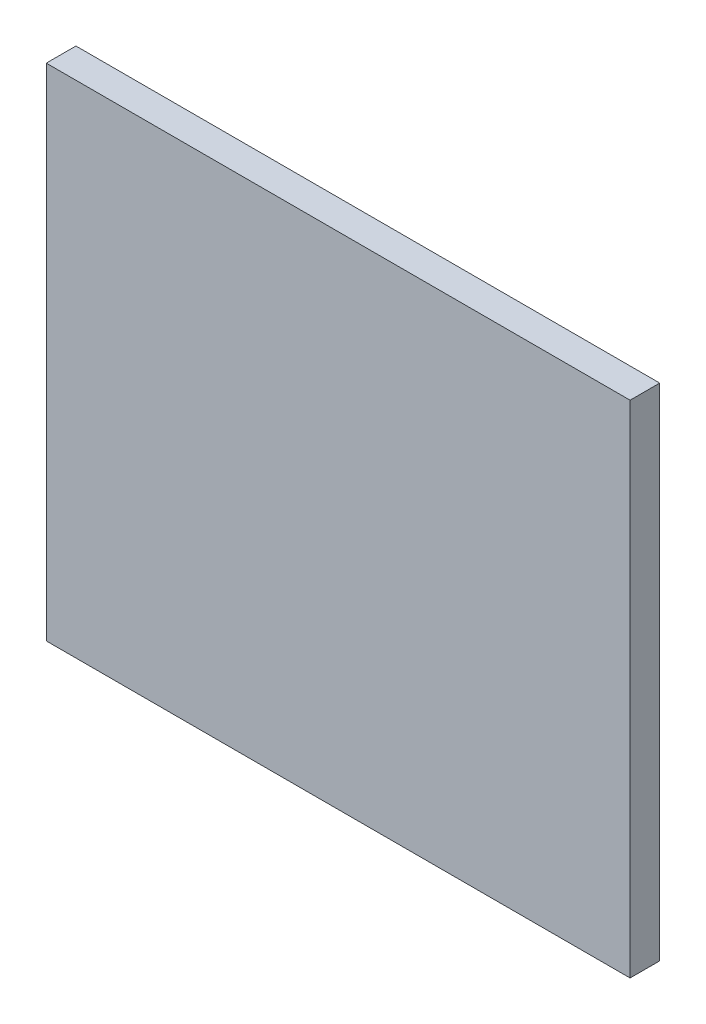
ISO-10303-21;
HEADER;
FILE_DESCRIPTION(('STEP AP214'),'2;1');
FILE_NAME('part.step','',(''),(''),'','','');
FILE_SCHEMA(('AUTOMOTIVE_DESIGN { 1 0 10303 214 1 1 1 1 }'));
ENDSEC;
DATA;
#1=APPLICATION_CONTEXT('core data for automotive mechanical design processes');
#2=APPLICATION_PROTOCOL_DEFINITION('international standard','automotive_design',2000,#1);
#3=PRODUCT_CONTEXT('',#1,'mechanical');
#4=PRODUCT('Part','Part','',(#3));
#5=PRODUCT_RELATED_PRODUCT_CATEGORY('part','',(#4));
#6=PRODUCT_DEFINITION_FORMATION('','',#4);
#7=PRODUCT_DEFINITION_CONTEXT('part definition',#1,'design');
#8=PRODUCT_DEFINITION('design','',#6,#7);
#9=PRODUCT_DEFINITION_SHAPE('','',#8);
#10=(LENGTH_UNIT() NAMED_UNIT(*) SI_UNIT(.MILLI.,.METRE.));
#11=(NAMED_UNIT(*) PLANE_ANGLE_UNIT() SI_UNIT($,.RADIAN.));
#12=(NAMED_UNIT(*) SI_UNIT($,.STERADIAN.) SOLID_ANGLE_UNIT());
#13=UNCERTAINTY_MEASURE_WITH_UNIT(LENGTH_MEASURE(1.E-05),#10,'distance_accuracy_value','');
#14=(GEOMETRIC_REPRESENTATION_CONTEXT(3) GLOBAL_UNCERTAINTY_ASSIGNED_CONTEXT((#13)) GLOBAL_UNIT_ASSIGNED_CONTEXT((#10,
#11,#12)) REPRESENTATION_CONTEXT('',''));
#15=CARTESIAN_POINT('',(0.,0.,0.));
#16=DIRECTION('',(0.,0.,1.));
#17=DIRECTION('',(1.,0.,0.));
#18=AXIS2_PLACEMENT_3D('',#15,#16,#17);
#19=CARTESIAN_POINT('',(98.6169967651367,84.4869995117188,0.));
#20=DIRECTION('',(0.,-1.,0.));
#21=DIRECTION('',(-1.,0.,0.));
#22=AXIS2_PLACEMENT_3D('',#19,#20,#21);
#23=PLANE('',#22);
#24=DIRECTION('',(-1.,0.,0.));
#25=VECTOR('',#24,1.);
#26=CARTESIAN_POINT('',(98.6169967651367,84.4869995117188,0.03556));
#27=LINE('',#26,#25);
#28=CARTESIAN_POINT('',(98.6169967651367,84.4869995117188,0.03556));
#29=VERTEX_POINT('',#28);
#30=CARTESIAN_POINT('',(97.9169998168945,84.4869995117188,0.03556));
#31=VERTEX_POINT('',#30);
#32=EDGE_CURVE('E11',#29,#31,#27,.T.);
#33=ORIENTED_EDGE('',*,*,#32,.F.);
#34=DIRECTION('',(0.,0.,1.));
#35=VECTOR('',#34,1.);
#36=CARTESIAN_POINT('',(98.6169967651367,84.4869995117188,0.));
#37=LINE('',#36,#35);
#38=CARTESIAN_POINT('',(98.6169967651367,84.4869995117188,0.));
#39=VERTEX_POINT('',#38);
#40=EDGE_CURVE('E24',#39,#29,#37,.T.);
#41=ORIENTED_EDGE('',*,*,#40,.F.);
#42=DIRECTION('',(-1.,0.,0.));
#43=VECTOR('',#42,1.);
#44=CARTESIAN_POINT('',(98.6169967651367,84.4869995117188,0.));
#45=LINE('',#44,#43);
#46=CARTESIAN_POINT('',(97.9169998168945,84.4869995117188,0.));
#47=VERTEX_POINT('',#46);
#48=EDGE_CURVE('E75',#39,#47,#45,.T.);
#49=ORIENTED_EDGE('',*,*,#48,.T.);
#50=DIRECTION('',(0.,0.,1.));
#51=VECTOR('',#50,1.);
#52=CARTESIAN_POINT('',(97.9169998168945,84.4869995117188,0.));
#53=LINE('',#52,#51);
#54=EDGE_CURVE('E37',#47,#31,#53,.T.);
#55=ORIENTED_EDGE('',*,*,#54,.T.);
#56=EDGE_LOOP('',(#33,#41,#49,#55));
#57=FACE_BOUND('',#56,.T.);
#58=ADVANCED_FACE('F17',(#57),#23,.F.);
#59=CARTESIAN_POINT('',(97.9169998168945,84.4869995117188,0.));
#60=DIRECTION('',(1.,0.,0.));
#61=DIRECTION('',(0.,-1.,0.));
#62=AXIS2_PLACEMENT_3D('',#59,#60,#61);
#63=PLANE('',#62);
#64=DIRECTION('',(0.,-1.,0.));
#65=VECTOR('',#64,1.);
#66=CARTESIAN_POINT('',(97.9169998168945,84.4869995117188,0.03556));
#67=LINE('',#66,#65);
#68=CARTESIAN_POINT('',(97.9169998168945,83.8870010375977,0.03556));
#69=VERTEX_POINT('',#68);
#70=EDGE_CURVE('E83',#31,#69,#67,.T.);
#71=ORIENTED_EDGE('',*,*,#70,.F.);
#72=ORIENTED_EDGE('',*,*,#54,.F.);
#73=DIRECTION('',(0.,-1.,0.));
#74=VECTOR('',#73,1.);
#75=CARTESIAN_POINT('',(97.9169998168945,84.4869995117188,0.));
#76=LINE('',#75,#74);
#77=CARTESIAN_POINT('',(97.9169998168945,83.8870010375977,0.));
#78=VERTEX_POINT('',#77);
#79=EDGE_CURVE('E81',#47,#78,#76,.T.);
#80=ORIENTED_EDGE('',*,*,#79,.T.);
#81=DIRECTION('',(0.,0.,1.));
#82=VECTOR('',#81,1.);
#83=CARTESIAN_POINT('',(97.9169998168945,83.8870010375977,0.));
#84=LINE('',#83,#82);
#85=EDGE_CURVE('E67',#78,#69,#84,.T.);
#86=ORIENTED_EDGE('',*,*,#85,.T.);
#87=EDGE_LOOP('',(#71,#72,#80,#86));
#88=FACE_BOUND('',#87,.T.);
#89=ADVANCED_FACE('F89',(#88),#63,.F.);
#90=CARTESIAN_POINT('',(97.9169998168945,83.8870010375977,0.));
#91=DIRECTION('',(0.,1.,0.));
#92=DIRECTION('',(1.,0.,0.));
#93=AXIS2_PLACEMENT_3D('',#90,#91,#92);
#94=PLANE('',#93);
#95=DIRECTION('',(1.,0.,0.));
#96=VECTOR('',#95,1.);
#97=CARTESIAN_POINT('',(97.9169998168945,83.8870010375977,0.03556));
#98=LINE('',#97,#96);
#99=CARTESIAN_POINT('',(98.6169967651367,83.8870010375977,0.03556));
#100=VERTEX_POINT('',#99);
#101=EDGE_CURVE('E71',#69,#100,#98,.T.);
#102=ORIENTED_EDGE('',*,*,#101,.F.);
#103=ORIENTED_EDGE('',*,*,#85,.F.);
#104=DIRECTION('',(1.,0.,0.));
#105=VECTOR('',#104,1.);
#106=CARTESIAN_POINT('',(97.9169998168945,83.8870010375977,0.));
#107=LINE('',#106,#105);
#108=CARTESIAN_POINT('',(98.6169967651367,83.8870010375977,0.));
#109=VERTEX_POINT('',#108);
#110=EDGE_CURVE('E63',#78,#109,#107,.T.);
#111=ORIENTED_EDGE('',*,*,#110,.T.);
#112=DIRECTION('',(0.,0.,1.));
#113=VECTOR('',#112,1.);
#114=CARTESIAN_POINT('',(98.6169967651367,83.8870010375977,0.));
#115=LINE('',#114,#113);
#116=EDGE_CURVE('E53',#109,#100,#115,.T.);
#117=ORIENTED_EDGE('',*,*,#116,.T.);
#118=EDGE_LOOP('',(#102,#103,#111,#117));
#119=FACE_BOUND('',#118,.T.);
#120=ADVANCED_FACE('F66',(#119),#94,.F.);
#121=CARTESIAN_POINT('',(98.6169967651367,83.8870010375977,0.));
#122=DIRECTION('',(-1.,0.,0.));
#123=DIRECTION('',(0.,1.,0.));
#124=AXIS2_PLACEMENT_3D('',#121,#122,#123);
#125=PLANE('',#124);
#126=DIRECTION('',(0.,1.,0.));
#127=VECTOR('',#126,1.);
#128=CARTESIAN_POINT('',(98.6169967651367,83.8870010375977,0.03556));
#129=LINE('',#128,#127);
#130=EDGE_CURVE('E59',#100,#29,#129,.T.);
#131=ORIENTED_EDGE('',*,*,#130,.F.);
#132=ORIENTED_EDGE('',*,*,#116,.F.);
#133=DIRECTION('',(0.,1.,0.));
#134=VECTOR('',#133,1.);
#135=CARTESIAN_POINT('',(98.6169967651367,83.8870010375977,0.));
#136=LINE('',#135,#134);
#137=EDGE_CURVE('E57',#109,#39,#136,.T.);
#138=ORIENTED_EDGE('',*,*,#137,.T.);
#139=ORIENTED_EDGE('',*,*,#40,.T.);
#140=EDGE_LOOP('',(#131,#132,#138,#139));
#141=FACE_BOUND('',#140,.T.);
#142=ADVANCED_FACE('F55',(#141),#125,.F.);
#143=CARTESIAN_POINT('',(98.6169967651367,84.4869995117188,0.));
#144=DIRECTION('',(0.,0.,-1.));
#145=DIRECTION('',(-1.,0.,0.));
#146=AXIS2_PLACEMENT_3D('',#143,#144,#145);
#147=PLANE('',#146);
#148=ORIENTED_EDGE('',*,*,#137,.F.);
#149=ORIENTED_EDGE('',*,*,#110,.F.);
#150=ORIENTED_EDGE('',*,*,#79,.F.);
#151=ORIENTED_EDGE('',*,*,#48,.F.);
#152=EDGE_LOOP('',(#148,#149,#150,#151));
#153=FACE_BOUND('',#152,.T.);
#154=ADVANCED_FACE('F74',(#153),#147,.T.);
#155=CARTESIAN_POINT('',(98.6169967651367,84.4869995117188,0.03556));
#156=DIRECTION('',(0.,0.,-1.));
#157=DIRECTION('',(-1.,0.,0.));
#158=AXIS2_PLACEMENT_3D('',#155,#156,#157);
#159=PLANE('',#158);
#160=ORIENTED_EDGE('',*,*,#32,.T.);
#161=ORIENTED_EDGE('',*,*,#70,.T.);
#162=ORIENTED_EDGE('',*,*,#101,.T.);
#163=ORIENTED_EDGE('',*,*,#130,.T.);
#164=EDGE_LOOP('',(#160,#161,#162,#163));
#165=FACE_BOUND('',#164,.T.);
#166=ADVANCED_FACE('F91',(#165),#159,.F.);
#167=CLOSED_SHELL('',(#58,#89,#120,#142,#154,#166));
#168=MANIFOLD_SOLID_BREP('B1',#167);
#169=ADVANCED_BREP_SHAPE_REPRESENTATION('',(#18,#168),#14);
#170=SHAPE_DEFINITION_REPRESENTATION(#9,#169);
ENDSEC;
END-ISO-10303-21;
